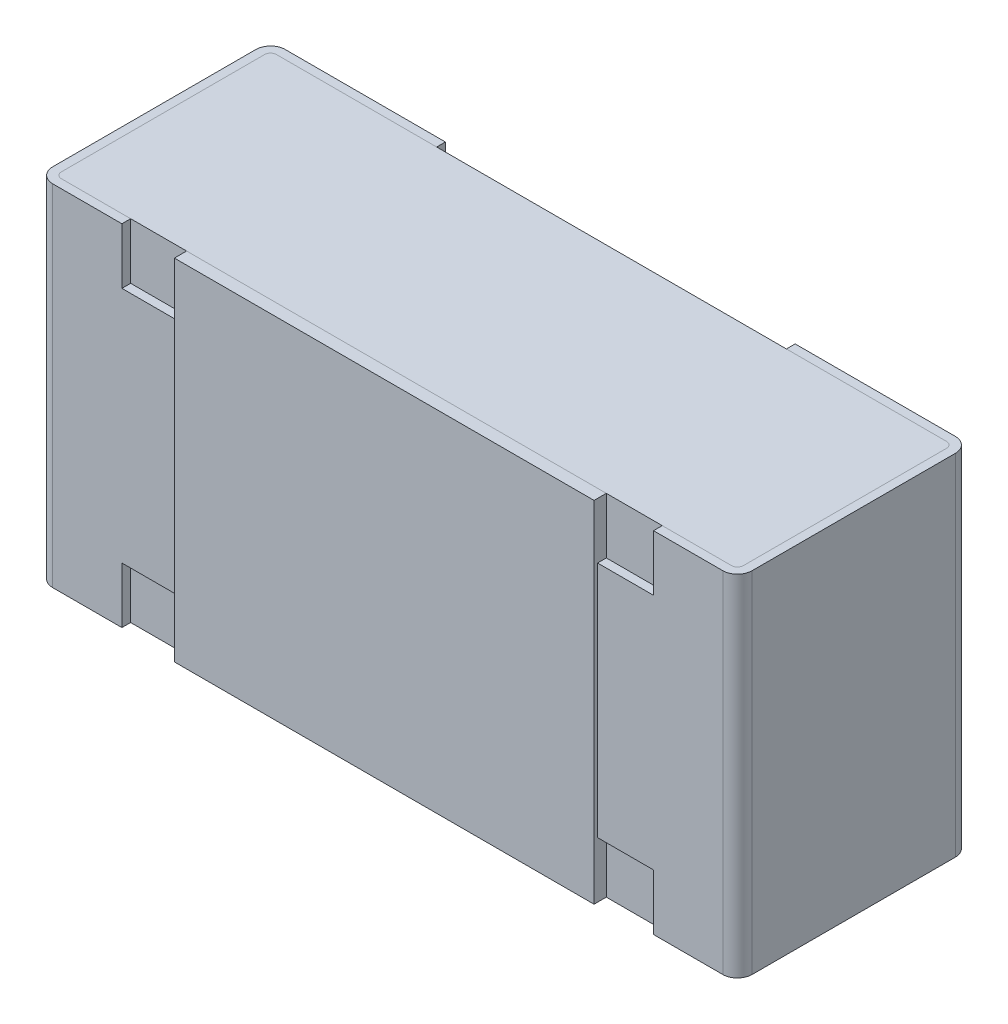
ISO-10303-21;
HEADER;
FILE_DESCRIPTION(('STEP AP214'),'2;1');
FILE_NAME('part.step','',(''),(''),'','','');
FILE_SCHEMA(('AUTOMOTIVE_DESIGN { 1 0 10303 214 1 1 1 1 }'));
ENDSEC;
DATA;
#1=APPLICATION_CONTEXT('core data for automotive mechanical design processes');
#2=APPLICATION_PROTOCOL_DEFINITION('international standard','automotive_design',2000,#1);
#3=PRODUCT_CONTEXT('',#1,'mechanical');
#4=PRODUCT('Part','Part','',(#3));
#5=PRODUCT_RELATED_PRODUCT_CATEGORY('part','',(#4));
#6=PRODUCT_DEFINITION_FORMATION('','',#4);
#7=PRODUCT_DEFINITION_CONTEXT('part definition',#1,'design');
#8=PRODUCT_DEFINITION('design','',#6,#7);
#9=PRODUCT_DEFINITION_SHAPE('','',#8);
#10=(LENGTH_UNIT() NAMED_UNIT(*) SI_UNIT(.MILLI.,.METRE.));
#11=(NAMED_UNIT(*) PLANE_ANGLE_UNIT() SI_UNIT($,.RADIAN.));
#12=(NAMED_UNIT(*) SI_UNIT($,.STERADIAN.) SOLID_ANGLE_UNIT());
#13=UNCERTAINTY_MEASURE_WITH_UNIT(LENGTH_MEASURE(1.E-05),#10,'distance_accuracy_value','');
#14=(GEOMETRIC_REPRESENTATION_CONTEXT(3) GLOBAL_UNCERTAINTY_ASSIGNED_CONTEXT((#13)) GLOBAL_UNIT_ASSIGNED_CONTEXT((#10,
#11,#12)) REPRESENTATION_CONTEXT('',''));
#15=CARTESIAN_POINT('',(0.,0.,0.));
#16=DIRECTION('',(0.,0.,1.));
#17=DIRECTION('',(1.,0.,0.));
#18=AXIS2_PLACEMENT_3D('',#15,#16,#17);
#19=CARTESIAN_POINT('',(0.3,-0.17,0.20686291501));
#20=DIRECTION('',(0.,1.,0.));
#21=DIRECTION('',(1.,0.,0.));
#22=AXIS2_PLACEMENT_3D('',#19,#20,#21);
#23=PLANE('',#22);
#24=DIRECTION('',(0.,0.,1.));
#25=VECTOR('',#24,1.);
#26=CARTESIAN_POINT('',(0.38,-0.17,0.32));
#27=LINE('',#26,#25);
#28=CARTESIAN_POINT('',(0.38,-0.17,0.32));
#29=VERTEX_POINT('',#28);
#30=CARTESIAN_POINT('',(0.38,-0.17,0.3325));
#31=VERTEX_POINT('',#30);
#32=EDGE_CURVE('E11',#29,#31,#27,.T.);
#33=ORIENTED_EDGE('',*,*,#32,.T.);
#34=DIRECTION('',(-1.,0.,0.));
#35=VECTOR('',#34,1.);
#36=CARTESIAN_POINT('',(0.38,-0.17,0.3325));
#37=LINE('',#36,#35);
#38=CARTESIAN_POINT('',(0.3,-0.17,0.3325));
#39=VERTEX_POINT('',#38);
#40=EDGE_CURVE('E365',#31,#39,#37,.T.);
#41=ORIENTED_EDGE('',*,*,#40,.T.);
#42=DIRECTION('',(0.,0.,1.));
#43=VECTOR('',#42,1.);
#44=CARTESIAN_POINT('',(0.3,-0.17,0.32));
#45=LINE('',#44,#43);
#46=CARTESIAN_POINT('',(0.3,-0.17,0.32));
#47=VERTEX_POINT('',#46);
#48=EDGE_CURVE('E435',#47,#39,#45,.T.);
#49=ORIENTED_EDGE('',*,*,#48,.F.);
#50=DIRECTION('',(-1.,0.,0.));
#51=VECTOR('',#50,1.);
#52=CARTESIAN_POINT('',(0.38,-0.17,0.32));
#53=LINE('',#52,#51);
#54=EDGE_CURVE('E484',#29,#47,#53,.T.);
#55=ORIENTED_EDGE('',*,*,#54,.F.);
#56=EDGE_LOOP('',(#33,#41,#49,#55));
#57=FACE_BOUND('',#56,.T.);
#58=ADVANCED_FACE('F17',(#57),#23,.F.);
#59=CARTESIAN_POINT('',(0.38,-0.25,0.20686291501));
#60=DIRECTION('',(1.,0.,0.));
#61=DIRECTION('',(0.,-1.,0.));
#62=AXIS2_PLACEMENT_3D('',#59,#60,#61);
#63=PLANE('',#62);
#64=DIRECTION('',(0.,0.,1.));
#65=VECTOR('',#64,1.);
#66=CARTESIAN_POINT('',(0.38,-0.25,0.32));
#67=LINE('',#66,#65);
#68=CARTESIAN_POINT('',(0.38,-0.25,0.32));
#69=VERTEX_POINT('',#68);
#70=CARTESIAN_POINT('',(0.38,-0.25,0.3325));
#71=VERTEX_POINT('',#70);
#72=EDGE_CURVE('E441',#69,#71,#67,.T.);
#73=ORIENTED_EDGE('',*,*,#72,.T.);
#74=DIRECTION('',(0.,1.,0.));
#75=VECTOR('',#74,1.);
#76=CARTESIAN_POINT('',(0.38,-0.25,0.3325));
#77=LINE('',#76,#75);
#78=EDGE_CURVE('E333',#71,#31,#77,.T.);
#79=ORIENTED_EDGE('',*,*,#78,.T.);
#80=ORIENTED_EDGE('',*,*,#32,.F.);
#81=DIRECTION('',(0.,1.,0.));
#82=VECTOR('',#81,1.);
#83=CARTESIAN_POINT('',(0.38,-0.25,0.32));
#84=LINE('',#83,#82);
#85=EDGE_CURVE('E480',#69,#29,#84,.T.);
#86=ORIENTED_EDGE('',*,*,#85,.F.);
#87=EDGE_LOOP('',(#73,#79,#80,#86));
#88=FACE_BOUND('',#87,.T.);
#89=ADVANCED_FACE('F1038',(#88),#63,.F.);
#90=CARTESIAN_POINT('',(0.38,0.25,0.20686291501));
#91=DIRECTION('',(1.,0.,0.));
#92=DIRECTION('',(0.,1.,0.));
#93=AXIS2_PLACEMENT_3D('',#90,#91,#92);
#94=PLANE('',#93);
#95=DIRECTION('',(0.,0.,1.));
#96=VECTOR('',#95,1.);
#97=CARTESIAN_POINT('',(0.38,0.17,0.32));
#98=LINE('',#97,#96);
#99=CARTESIAN_POINT('',(0.38,0.17,0.32));
#100=VERTEX_POINT('',#99);
#101=CARTESIAN_POINT('',(0.38,0.17,0.3325));
#102=VERTEX_POINT('',#101);
#103=EDGE_CURVE('E25',#100,#102,#98,.T.);
#104=ORIENTED_EDGE('',*,*,#103,.T.);
#105=DIRECTION('',(0.,1.,0.));
#106=VECTOR('',#105,1.);
#107=CARTESIAN_POINT('',(0.38,0.17,0.3325));
#108=LINE('',#107,#106);
#109=CARTESIAN_POINT('',(0.38,0.25,0.3325));
#110=VERTEX_POINT('',#109);
#111=EDGE_CURVE('E324',#102,#110,#108,.T.);
#112=ORIENTED_EDGE('',*,*,#111,.T.);
#113=DIRECTION('',(0.,0.,1.));
#114=VECTOR('',#113,1.);
#115=CARTESIAN_POINT('',(0.38,0.25,0.32));
#116=LINE('',#115,#114);
#117=CARTESIAN_POINT('',(0.38,0.25,0.32));
#118=VERTEX_POINT('',#117);
#119=EDGE_CURVE('E328',#118,#110,#116,.T.);
#120=ORIENTED_EDGE('',*,*,#119,.F.);
#121=DIRECTION('',(0.,1.,0.));
#122=VECTOR('',#121,1.);
#123=CARTESIAN_POINT('',(0.38,0.17,0.32));
#124=LINE('',#123,#122);
#125=EDGE_CURVE('E456',#100,#118,#124,.T.);
#126=ORIENTED_EDGE('',*,*,#125,.F.);
#127=EDGE_LOOP('',(#104,#112,#120,#126));
#128=FACE_BOUND('',#127,.T.);
#129=ADVANCED_FACE('F326',(#128),#94,.F.);
#130=CARTESIAN_POINT('',(0.3,0.17,0.20686291501));
#131=DIRECTION('',(0.,-1.,0.));
#132=DIRECTION('',(0.,0.,-1.));
#133=AXIS2_PLACEMENT_3D('',#130,#131,#132);
#134=PLANE('',#133);
#135=DIRECTION('',(0.,0.,1.));
#136=VECTOR('',#135,1.);
#137=CARTESIAN_POINT('',(0.3,0.17,0.32));
#138=LINE('',#137,#136);
#139=CARTESIAN_POINT('',(0.3,0.17,0.32));
#140=VERTEX_POINT('',#139);
#141=CARTESIAN_POINT('',(0.3,0.17,0.3325));
#142=VERTEX_POINT('',#141);
#143=EDGE_CURVE('E587',#140,#142,#138,.T.);
#144=ORIENTED_EDGE('',*,*,#143,.T.);
#145=DIRECTION('',(1.,0.,0.));
#146=VECTOR('',#145,1.);
#147=CARTESIAN_POINT('',(0.3,0.17,0.3325));
#148=LINE('',#147,#146);
#149=EDGE_CURVE('E332',#142,#102,#148,.T.);
#150=ORIENTED_EDGE('',*,*,#149,.T.);
#151=ORIENTED_EDGE('',*,*,#103,.F.);
#152=DIRECTION('',(1.,0.,0.));
#153=VECTOR('',#152,1.);
#154=CARTESIAN_POINT('',(0.3,0.17,0.32));
#155=LINE('',#154,#153);
#156=EDGE_CURVE('E461',#140,#100,#155,.T.);
#157=ORIENTED_EDGE('',*,*,#156,.F.);
#158=EDGE_LOOP('',(#144,#150,#151,#157));
#159=FACE_BOUND('',#158,.T.);
#160=ADVANCED_FACE('F1052',(#159),#134,.F.);
#161=CARTESIAN_POINT('',(0.5,0.,0.3325));
#162=DIRECTION('',(0.,0.,-1.));
#163=DIRECTION('',(-1.,0.,0.));
#164=AXIS2_PLACEMENT_3D('',#161,#162,#163);
#165=PLANE('',#164);
#166=ORIENTED_EDGE('',*,*,#40,.F.);
#167=ORIENTED_EDGE('',*,*,#78,.F.);
#168=DIRECTION('',(-1.,0.,0.));
#169=VECTOR('',#168,1.);
#170=CARTESIAN_POINT('',(0.479,-0.25,0.3325));
#171=LINE('',#170,#169);
#172=CARTESIAN_POINT('',(0.479,-0.25,0.3325));
#173=VERTEX_POINT('',#172);
#174=EDGE_CURVE('E446',#173,#71,#171,.T.);
#175=ORIENTED_EDGE('',*,*,#174,.F.);
#176=DIRECTION('',(0.,1.,0.));
#177=VECTOR('',#176,1.);
#178=CARTESIAN_POINT('',(0.479,-0.25,0.3325));
#179=LINE('',#178,#177);
#180=CARTESIAN_POINT('',(0.479,0.25,0.3325));
#181=VERTEX_POINT('',#180);
#182=EDGE_CURVE('E340',#173,#181,#179,.T.);
#183=ORIENTED_EDGE('',*,*,#182,.T.);
#184=DIRECTION('',(-1.,0.,0.));
#185=VECTOR('',#184,1.);
#186=CARTESIAN_POINT('',(0.479,0.25,0.3325));
#187=LINE('',#186,#185);
#188=EDGE_CURVE('E336',#181,#110,#187,.T.);
#189=ORIENTED_EDGE('',*,*,#188,.T.);
#190=ORIENTED_EDGE('',*,*,#111,.F.);
#191=ORIENTED_EDGE('',*,*,#149,.F.);
#192=DIRECTION('',(0.,1.,0.));
#193=VECTOR('',#192,1.);
#194=CARTESIAN_POINT('',(0.3,-0.17,0.3325));
#195=LINE('',#194,#193);
#196=EDGE_CURVE('E439',#39,#142,#195,.T.);
#197=ORIENTED_EDGE('',*,*,#196,.F.);
#198=EDGE_LOOP('',(#166,#167,#175,#183,#189,#190,#191,#197));
#199=FACE_BOUND('',#198,.T.);
#200=ADVANCED_FACE('F338',(#199),#165,.F.);
#201=CARTESIAN_POINT('',(0.479,0.,0.3115));
#202=DIRECTION('',(0.,-1.,0.));
#203=DIRECTION('',(0.,0.,-1.));
#204=AXIS2_PLACEMENT_3D('',#201,#202,#203);
#205=CYLINDRICAL_SURFACE('',#204,0.021);
#206=CARTESIAN_POINT('',(0.479,-0.25,0.3115));
#207=DIRECTION('',(0.,1.,0.));
#208=DIRECTION('',(0.,0.,1.));
#209=AXIS2_PLACEMENT_3D('',#206,#207,#208);
#210=CIRCLE('',#209,0.021);
#211=CARTESIAN_POINT('',(0.5,-0.25,0.3115));
#212=VERTEX_POINT('',#211);
#213=EDGE_CURVE('E500',#173,#212,#210,.T.);
#214=ORIENTED_EDGE('',*,*,#213,.T.);
#215=DIRECTION('',(0.,1.,0.));
#216=VECTOR('',#215,1.);
#217=CARTESIAN_POINT('',(0.5,-0.25,0.3115));
#218=LINE('',#217,#216);
#219=CARTESIAN_POINT('',(0.5,0.25,0.3115));
#220=VERTEX_POINT('',#219);
#221=EDGE_CURVE('E475',#212,#220,#218,.T.);
#222=ORIENTED_EDGE('',*,*,#221,.T.);
#223=CARTESIAN_POINT('',(0.479,0.25,0.3115));
#224=DIRECTION('',(0.,-1.,0.));
#225=DIRECTION('',(0.,0.,-1.));
#226=AXIS2_PLACEMENT_3D('',#223,#224,#225);
#227=CIRCLE('',#226,0.021);
#228=EDGE_CURVE('E345',#220,#181,#227,.T.);
#229=ORIENTED_EDGE('',*,*,#228,.T.);
#230=ORIENTED_EDGE('',*,*,#182,.F.);
#231=EDGE_LOOP('',(#214,#222,#229,#230));
#232=FACE_BOUND('',#231,.T.);
#233=ADVANCED_FACE('F673',(#232),#205,.T.);
#234=CARTESIAN_POINT('',(0.25,0.,0.));
#235=DIRECTION('',(1.,0.,0.));
#236=DIRECTION('',(0.,0.,1.));
#237=AXIS2_PLACEMENT_3D('',#234,#235,#236);
#238=PLANE('',#237);
#239=DIRECTION('',(0.,0.,1.));
#240=VECTOR('',#239,1.);
#241=CARTESIAN_POINT('',(0.25,0.25,0.));
#242=LINE('',#241,#240);
#243=CARTESIAN_POINT('',(0.25,0.25,0.));
#244=VERTEX_POINT('',#243);
#245=CARTESIAN_POINT('',(0.25,0.25,0.0125));
#246=VERTEX_POINT('',#245);
#247=EDGE_CURVE('E730',#244,#246,#242,.T.);
#248=ORIENTED_EDGE('',*,*,#247,.F.);
#249=DIRECTION('',(0.,1.,0.));
#250=VECTOR('',#249,1.);
#251=CARTESIAN_POINT('',(0.25,-0.25,0.));
#252=LINE('',#251,#250);
#253=CARTESIAN_POINT('',(0.25,-0.25,0.));
#254=VERTEX_POINT('',#253);
#255=EDGE_CURVE('E544',#254,#244,#252,.T.);
#256=ORIENTED_EDGE('',*,*,#255,.F.);
#257=DIRECTION('',(0.,0.,1.));
#258=VECTOR('',#257,1.);
#259=CARTESIAN_POINT('',(0.25,-0.25,0.));
#260=LINE('',#259,#258);
#261=CARTESIAN_POINT('',(0.25,-0.25,0.0125));
#262=VERTEX_POINT('',#261);
#263=EDGE_CURVE('E575',#254,#262,#260,.T.);
#264=ORIENTED_EDGE('',*,*,#263,.T.);
#265=DIRECTION('',(0.,1.,0.));
#266=VECTOR('',#265,1.);
#267=CARTESIAN_POINT('',(0.25,-0.25,0.0125));
#268=LINE('',#267,#266);
#269=EDGE_CURVE('E416',#262,#246,#268,.T.);
#270=ORIENTED_EDGE('',*,*,#269,.T.);
#271=EDGE_LOOP('',(#248,#256,#264,#270));
#272=FACE_BOUND('',#271,.T.);
#273=ADVANCED_FACE('F732',(#272),#238,.F.);
#274=CARTESIAN_POINT('',(0.25,0.,0.));
#275=DIRECTION('',(0.,0.,1.));
#276=DIRECTION('',(1.,0.,0.));
#277=AXIS2_PLACEMENT_3D('',#274,#275,#276);
#278=PLANE('',#277);
#279=DIRECTION('',(1.,0.,0.));
#280=VECTOR('',#279,1.);
#281=CARTESIAN_POINT('',(0.25,-0.25,0.));
#282=LINE('',#281,#280);
#283=CARTESIAN_POINT('',(0.479,-0.25,0.));
#284=VERTEX_POINT('',#283);
#285=EDGE_CURVE('E583',#254,#284,#282,.T.);
#286=ORIENTED_EDGE('',*,*,#285,.F.);
#287=ORIENTED_EDGE('',*,*,#255,.T.);
#288=DIRECTION('',(1.,0.,0.));
#289=VECTOR('',#288,1.);
#290=CARTESIAN_POINT('',(0.25,0.25,0.));
#291=LINE('',#290,#289);
#292=CARTESIAN_POINT('',(0.479,0.25,0.));
#293=VERTEX_POINT('',#292);
#294=EDGE_CURVE('E370',#244,#293,#291,.T.);
#295=ORIENTED_EDGE('',*,*,#294,.T.);
#296=DIRECTION('',(0.,1.,0.));
#297=VECTOR('',#296,1.);
#298=CARTESIAN_POINT('',(0.479,-0.25,0.));
#299=LINE('',#298,#297);
#300=EDGE_CURVE('E474',#284,#293,#299,.T.);
#301=ORIENTED_EDGE('',*,*,#300,.F.);
#302=EDGE_LOOP('',(#286,#287,#295,#301));
#303=FACE_BOUND('',#302,.T.);
#304=ADVANCED_FACE('F727',(#303),#278,.F.);
#305=CARTESIAN_POINT('',(0.479,0.,0.021));
#306=DIRECTION('',(0.,-1.,0.));
#307=DIRECTION('',(0.,0.,-1.));
#308=AXIS2_PLACEMENT_3D('',#305,#306,#307);
#309=CYLINDRICAL_SURFACE('',#308,0.021);
#310=CARTESIAN_POINT('',(0.479,-0.25,0.021));
#311=DIRECTION('',(0.,1.,0.));
#312=DIRECTION('',(0.,0.,1.));
#313=AXIS2_PLACEMENT_3D('',#310,#311,#312);
#314=CIRCLE('',#313,0.021);
#315=CARTESIAN_POINT('',(0.5,-0.25,0.021));
#316=VERTEX_POINT('',#315);
#317=EDGE_CURVE('E501',#316,#284,#314,.T.);
#318=ORIENTED_EDGE('',*,*,#317,.T.);
#319=ORIENTED_EDGE('',*,*,#300,.T.);
#320=CARTESIAN_POINT('',(0.479,0.25,0.021));
#321=DIRECTION('',(0.,-1.,0.));
#322=DIRECTION('',(0.,0.,-1.));
#323=AXIS2_PLACEMENT_3D('',#320,#321,#322);
#324=CIRCLE('',#323,0.021);
#325=CARTESIAN_POINT('',(0.5,0.25,0.021));
#326=VERTEX_POINT('',#325);
#327=EDGE_CURVE('E366',#293,#326,#324,.T.);
#328=ORIENTED_EDGE('',*,*,#327,.T.);
#329=DIRECTION('',(0.,1.,0.));
#330=VECTOR('',#329,1.);
#331=CARTESIAN_POINT('',(0.5,-0.25,0.021));
#332=LINE('',#331,#330);
#333=EDGE_CURVE('E471',#316,#326,#332,.T.);
#334=ORIENTED_EDGE('',*,*,#333,.F.);
#335=EDGE_LOOP('',(#318,#319,#328,#334));
#336=FACE_BOUND('',#335,.T.);
#337=ADVANCED_FACE('F722',(#336),#309,.T.);
#338=CARTESIAN_POINT('',(0.5,0.,0.));
#339=DIRECTION('',(-1.,0.,0.));
#340=DIRECTION('',(0.,0.,1.));
#341=AXIS2_PLACEMENT_3D('',#338,#339,#340);
#342=PLANE('',#341);
#343=DIRECTION('',(0.,0.,1.));
#344=VECTOR('',#343,1.);
#345=CARTESIAN_POINT('',(0.5,0.25,0.021));
#346=LINE('',#345,#344);
#347=EDGE_CURVE('E371',#326,#220,#346,.T.);
#348=ORIENTED_EDGE('',*,*,#347,.T.);
#349=ORIENTED_EDGE('',*,*,#221,.F.);
#350=DIRECTION('',(0.,0.,1.));
#351=VECTOR('',#350,1.);
#352=CARTESIAN_POINT('',(0.5,-0.25,0.021));
#353=LINE('',#352,#351);
#354=EDGE_CURVE('E496',#316,#212,#353,.T.);
#355=ORIENTED_EDGE('',*,*,#354,.F.);
#356=ORIENTED_EDGE('',*,*,#333,.T.);
#357=EDGE_LOOP('',(#348,#349,#355,#356));
#358=FACE_BOUND('',#357,.T.);
#359=ADVANCED_FACE('F678',(#358),#342,.F.);
#360=CARTESIAN_POINT('',(-0.3,0.17,0.20686291501));
#361=DIRECTION('',(0.,-1.,0.));
#362=DIRECTION('',(0.,0.,-1.));
#363=AXIS2_PLACEMENT_3D('',#360,#361,#362);
#364=PLANE('',#363);
#365=DIRECTION('',(0.,0.,1.));
#366=VECTOR('',#365,1.);
#367=CARTESIAN_POINT('',(-0.38,0.17,0.32));
#368=LINE('',#367,#366);
#369=CARTESIAN_POINT('',(-0.38,0.17,0.32));
#370=VERTEX_POINT('',#369);
#371=CARTESIAN_POINT('',(-0.38,0.17,0.3325));
#372=VERTEX_POINT('',#371);
#373=EDGE_CURVE('E666',#370,#372,#368,.T.);
#374=ORIENTED_EDGE('',*,*,#373,.T.);
#375=DIRECTION('',(1.,0.,0.));
#376=VECTOR('',#375,1.);
#377=CARTESIAN_POINT('',(-0.38,0.17,0.3325));
#378=LINE('',#377,#376);
#379=CARTESIAN_POINT('',(-0.3,0.17,0.3325));
#380=VERTEX_POINT('',#379);
#381=EDGE_CURVE('E565',#372,#380,#378,.T.);
#382=ORIENTED_EDGE('',*,*,#381,.T.);
#383=DIRECTION('',(0.,0.,1.));
#384=VECTOR('',#383,1.);
#385=CARTESIAN_POINT('',(-0.3,0.17,0.32));
#386=LINE('',#385,#384);
#387=CARTESIAN_POINT('',(-0.3,0.17,0.32));
#388=VERTEX_POINT('',#387);
#389=EDGE_CURVE('E455',#388,#380,#386,.T.);
#390=ORIENTED_EDGE('',*,*,#389,.F.);
#391=DIRECTION('',(1.,0.,0.));
#392=VECTOR('',#391,1.);
#393=CARTESIAN_POINT('',(-0.38,0.17,0.32));
#394=LINE('',#393,#392);
#395=EDGE_CURVE('E505',#370,#388,#394,.T.);
#396=ORIENTED_EDGE('',*,*,#395,.F.);
#397=EDGE_LOOP('',(#374,#382,#390,#396));
#398=FACE_BOUND('',#397,.T.);
#399=ADVANCED_FACE('F1096',(#398),#364,.F.);
#400=CARTESIAN_POINT('',(-0.38,0.25,0.20686291501));
#401=DIRECTION('',(-1.,0.,0.));
#402=DIRECTION('',(0.,0.,1.));
#403=AXIS2_PLACEMENT_3D('',#400,#401,#402);
#404=PLANE('',#403);
#405=DIRECTION('',(0.,0.,1.));
#406=VECTOR('',#405,1.);
#407=CARTESIAN_POINT('',(-0.38,0.25,0.32));
#408=LINE('',#407,#406);
#409=CARTESIAN_POINT('',(-0.38,0.25,0.32));
#410=VERTEX_POINT('',#409);
#411=CARTESIAN_POINT('',(-0.38,0.25,0.3325));
#412=VERTEX_POINT('',#411);
#413=EDGE_CURVE('E466',#410,#412,#408,.T.);
#414=ORIENTED_EDGE('',*,*,#413,.T.);
#415=DIRECTION('',(0.,-1.,0.));
#416=VECTOR('',#415,1.);
#417=CARTESIAN_POINT('',(-0.38,0.25,0.3325));
#418=LINE('',#417,#416);
#419=EDGE_CURVE('E629',#412,#372,#418,.T.);
#420=ORIENTED_EDGE('',*,*,#419,.T.);
#421=ORIENTED_EDGE('',*,*,#373,.F.);
#422=DIRECTION('',(0.,-1.,0.));
#423=VECTOR('',#422,1.);
#424=CARTESIAN_POINT('',(-0.38,0.25,0.32));
#425=LINE('',#424,#423);
#426=EDGE_CURVE('E510',#410,#370,#425,.T.);
#427=ORIENTED_EDGE('',*,*,#426,.F.);
#428=EDGE_LOOP('',(#414,#420,#421,#427));
#429=FACE_BOUND('',#428,.T.);
#430=ADVANCED_FACE('F1111',(#429),#404,.F.);
#431=CARTESIAN_POINT('',(-0.38,-0.25,0.20686291501));
#432=DIRECTION('',(-1.,0.,0.));
#433=DIRECTION('',(0.,0.,1.));
#434=AXIS2_PLACEMENT_3D('',#431,#432,#433);
#435=PLANE('',#434);
#436=DIRECTION('',(0.,0.,1.));
#437=VECTOR('',#436,1.);
#438=CARTESIAN_POINT('',(-0.38,-0.17,0.32));
#439=LINE('',#438,#437);
#440=CARTESIAN_POINT('',(-0.38,-0.17,0.32));
#441=VERTEX_POINT('',#440);
#442=CARTESIAN_POINT('',(-0.38,-0.17,0.3325));
#443=VERTEX_POINT('',#442);
#444=EDGE_CURVE('E375',#441,#443,#439,.T.);
#445=ORIENTED_EDGE('',*,*,#444,.T.);
#446=DIRECTION('',(0.,-1.,0.));
#447=VECTOR('',#446,1.);
#448=CARTESIAN_POINT('',(-0.38,-0.17,0.3325));
#449=LINE('',#448,#447);
#450=CARTESIAN_POINT('',(-0.38,-0.25,0.3325));
#451=VERTEX_POINT('',#450);
#452=EDGE_CURVE('E430',#443,#451,#449,.T.);
#453=ORIENTED_EDGE('',*,*,#452,.T.);
#454=DIRECTION('',(0.,0.,1.));
#455=VECTOR('',#454,1.);
#456=CARTESIAN_POINT('',(-0.38,-0.25,0.32));
#457=LINE('',#456,#455);
#458=CARTESIAN_POINT('',(-0.38,-0.25,0.32));
#459=VERTEX_POINT('',#458);
#460=EDGE_CURVE('E525',#459,#451,#457,.T.);
#461=ORIENTED_EDGE('',*,*,#460,.F.);
#462=DIRECTION('',(0.,-1.,0.));
#463=VECTOR('',#462,1.);
#464=CARTESIAN_POINT('',(-0.38,-0.17,0.32));
#465=LINE('',#464,#463);
#466=EDGE_CURVE('E538',#441,#459,#465,.T.);
#467=ORIENTED_EDGE('',*,*,#466,.F.);
#468=EDGE_LOOP('',(#445,#453,#461,#467));
#469=FACE_BOUND('',#468,.T.);
#470=ADVANCED_FACE('F1117',(#469),#435,.F.);
#471=CARTESIAN_POINT('',(-0.3,-0.17,0.20686291501));
#472=DIRECTION('',(0.,1.,0.));
#473=DIRECTION('',(1.,0.,0.));
#474=AXIS2_PLACEMENT_3D('',#471,#472,#473);
#475=PLANE('',#474);
#476=DIRECTION('',(0.,0.,1.));
#477=VECTOR('',#476,1.);
#478=CARTESIAN_POINT('',(-0.3,-0.17,0.32));
#479=LINE('',#478,#477);
#480=CARTESIAN_POINT('',(-0.3,-0.17,0.32));
#481=VERTEX_POINT('',#480);
#482=CARTESIAN_POINT('',(-0.3,-0.17,0.3325));
#483=VERTEX_POINT('',#482);
#484=EDGE_CURVE('E641',#481,#483,#479,.T.);
#485=ORIENTED_EDGE('',*,*,#484,.T.);
#486=DIRECTION('',(-1.,0.,0.));
#487=VECTOR('',#486,1.);
#488=CARTESIAN_POINT('',(-0.3,-0.17,0.3325));
#489=LINE('',#488,#487);
#490=EDGE_CURVE('E425',#483,#443,#489,.T.);
#491=ORIENTED_EDGE('',*,*,#490,.T.);
#492=ORIENTED_EDGE('',*,*,#444,.F.);
#493=DIRECTION('',(-1.,0.,0.));
#494=VECTOR('',#493,1.);
#495=CARTESIAN_POINT('',(-0.3,-0.17,0.32));
#496=LINE('',#495,#494);
#497=EDGE_CURVE('E534',#481,#441,#496,.T.);
#498=ORIENTED_EDGE('',*,*,#497,.F.);
#499=EDGE_LOOP('',(#485,#491,#492,#498));
#500=FACE_BOUND('',#499,.T.);
#501=ADVANCED_FACE('F1121',(#500),#475,.F.);
#502=CARTESIAN_POINT('',(-0.479,0.,0.3115));
#503=DIRECTION('',(0.,-1.,0.));
#504=DIRECTION('',(0.,0.,-1.));
#505=AXIS2_PLACEMENT_3D('',#502,#503,#504);
#506=CYLINDRICAL_SURFACE('',#505,0.021);
#507=CARTESIAN_POINT('',(-0.479,-0.25,0.3115));
#508=DIRECTION('',(0.,1.,0.));
#509=DIRECTION('',(0.,0.,1.));
#510=AXIS2_PLACEMENT_3D('',#507,#508,#509);
#511=CIRCLE('',#510,0.021);
#512=CARTESIAN_POINT('',(-0.5,-0.25,0.3115));
#513=VERTEX_POINT('',#512);
#514=CARTESIAN_POINT('',(-0.479,-0.25,0.3325));
#515=VERTEX_POINT('',#514);
#516=EDGE_CURVE('E533',#513,#515,#511,.T.);
#517=ORIENTED_EDGE('',*,*,#516,.T.);
#518=DIRECTION('',(0.,1.,0.));
#519=VECTOR('',#518,1.);
#520=CARTESIAN_POINT('',(-0.479,-0.25,0.3325));
#521=LINE('',#520,#519);
#522=CARTESIAN_POINT('',(-0.479,0.25,0.3325));
#523=VERTEX_POINT('',#522);
#524=EDGE_CURVE('E594',#515,#523,#521,.T.);
#525=ORIENTED_EDGE('',*,*,#524,.T.);
#526=CARTESIAN_POINT('',(-0.479,0.25,0.3115));
#527=DIRECTION('',(0.,-1.,0.));
#528=DIRECTION('',(0.,0.,-1.));
#529=AXIS2_PLACEMENT_3D('',#526,#527,#528);
#530=CIRCLE('',#529,0.021);
#531=CARTESIAN_POINT('',(-0.5,0.25,0.3115));
#532=VERTEX_POINT('',#531);
#533=EDGE_CURVE('E361',#523,#532,#530,.T.);
#534=ORIENTED_EDGE('',*,*,#533,.T.);
#535=DIRECTION('',(0.,1.,0.));
#536=VECTOR('',#535,1.);
#537=CARTESIAN_POINT('',(-0.5,-0.25,0.3115));
#538=LINE('',#537,#536);
#539=EDGE_CURVE('E392',#513,#532,#538,.T.);
#540=ORIENTED_EDGE('',*,*,#539,.F.);
#541=EDGE_LOOP('',(#517,#525,#534,#540));
#542=FACE_BOUND('',#541,.T.);
#543=ADVANCED_FACE('F1130',(#542),#506,.T.);
#544=CARTESIAN_POINT('',(-0.479,0.,0.021));
#545=DIRECTION('',(0.,-1.,0.));
#546=DIRECTION('',(0.,0.,-1.));
#547=AXIS2_PLACEMENT_3D('',#544,#545,#546);
#548=CYLINDRICAL_SURFACE('',#547,0.021);
#549=CARTESIAN_POINT('',(-0.479,-0.25,0.021));
#550=DIRECTION('',(0.,1.,0.));
#551=DIRECTION('',(0.,0.,1.));
#552=AXIS2_PLACEMENT_3D('',#549,#550,#551);
#553=CIRCLE('',#552,0.021);
#554=CARTESIAN_POINT('',(-0.479,-0.25,0.));
#555=VERTEX_POINT('',#554);
#556=CARTESIAN_POINT('',(-0.5,-0.25,0.021));
#557=VERTEX_POINT('',#556);
#558=EDGE_CURVE('E543',#555,#557,#553,.T.);
#559=ORIENTED_EDGE('',*,*,#558,.T.);
#560=DIRECTION('',(0.,1.,0.));
#561=VECTOR('',#560,1.);
#562=CARTESIAN_POINT('',(-0.5,-0.25,0.021));
#563=LINE('',#562,#561);
#564=CARTESIAN_POINT('',(-0.5,0.25,0.021));
#565=VERTEX_POINT('',#564);
#566=EDGE_CURVE('E376',#557,#565,#563,.T.);
#567=ORIENTED_EDGE('',*,*,#566,.T.);
#568=CARTESIAN_POINT('',(-0.479,0.25,0.021));
#569=DIRECTION('',(0.,-1.,0.));
#570=DIRECTION('',(0.,0.,-1.));
#571=AXIS2_PLACEMENT_3D('',#568,#569,#570);
#572=CIRCLE('',#571,0.021);
#573=CARTESIAN_POINT('',(-0.479,0.25,0.));
#574=VERTEX_POINT('',#573);
#575=EDGE_CURVE('E424',#565,#574,#572,.T.);
#576=ORIENTED_EDGE('',*,*,#575,.T.);
#577=DIRECTION('',(0.,1.,0.));
#578=VECTOR('',#577,1.);
#579=CARTESIAN_POINT('',(-0.479,-0.25,0.));
#580=LINE('',#579,#578);
#581=EDGE_CURVE('E372',#555,#574,#580,.T.);
#582=ORIENTED_EDGE('',*,*,#581,.F.);
#583=EDGE_LOOP('',(#559,#567,#576,#582));
#584=FACE_BOUND('',#583,.T.);
#585=ADVANCED_FACE('F767',(#584),#548,.T.);
#586=CARTESIAN_POINT('',(-0.5,0.,0.));
#587=DIRECTION('',(0.,0.,1.));
#588=DIRECTION('',(1.,0.,0.));
#589=AXIS2_PLACEMENT_3D('',#586,#587,#588);
#590=PLANE('',#589);
#591=DIRECTION('',(1.,0.,0.));
#592=VECTOR('',#591,1.);
#593=CARTESIAN_POINT('',(-0.479,0.25,0.));
#594=LINE('',#593,#592);
#595=CARTESIAN_POINT('',(-0.25,0.25,0.));
#596=VERTEX_POINT('',#595);
#597=EDGE_CURVE('E420',#574,#596,#594,.T.);
#598=ORIENTED_EDGE('',*,*,#597,.T.);
#599=DIRECTION('',(0.,1.,0.));
#600=VECTOR('',#599,1.);
#601=CARTESIAN_POINT('',(-0.25,-0.25,0.));
#602=LINE('',#601,#600);
#603=CARTESIAN_POINT('',(-0.25,-0.25,0.));
#604=VERTEX_POINT('',#603);
#605=EDGE_CURVE('E429',#604,#596,#602,.T.);
#606=ORIENTED_EDGE('',*,*,#605,.F.);
#607=DIRECTION('',(1.,0.,0.));
#608=VECTOR('',#607,1.);
#609=CARTESIAN_POINT('',(-0.479,-0.25,0.));
#610=LINE('',#609,#608);
#611=EDGE_CURVE('E550',#555,#604,#610,.T.);
#612=ORIENTED_EDGE('',*,*,#611,.F.);
#613=ORIENTED_EDGE('',*,*,#581,.T.);
#614=EDGE_LOOP('',(#598,#606,#612,#613));
#615=FACE_BOUND('',#614,.T.);
#616=ADVANCED_FACE('F763',(#615),#590,.F.);
#617=CARTESIAN_POINT('',(-0.5,0.,0.3325));
#618=DIRECTION('',(1.,0.,0.));
#619=DIRECTION('',(0.,1.,0.));
#620=AXIS2_PLACEMENT_3D('',#617,#618,#619);
#621=PLANE('',#620);
#622=DIRECTION('',(0.,0.,-1.));
#623=VECTOR('',#622,1.);
#624=CARTESIAN_POINT('',(-0.5,-0.25,0.3115));
#625=LINE('',#624,#623);
#626=EDGE_CURVE('E539',#513,#557,#625,.T.);
#627=ORIENTED_EDGE('',*,*,#626,.F.);
#628=ORIENTED_EDGE('',*,*,#539,.T.);
#629=DIRECTION('',(0.,0.,-1.));
#630=VECTOR('',#629,1.);
#631=CARTESIAN_POINT('',(-0.5,0.25,0.3115));
#632=LINE('',#631,#630);
#633=EDGE_CURVE('E434',#532,#565,#632,.T.);
#634=ORIENTED_EDGE('',*,*,#633,.T.);
#635=ORIENTED_EDGE('',*,*,#566,.F.);
#636=EDGE_LOOP('',(#627,#628,#634,#635));
#637=FACE_BOUND('',#636,.T.);
#638=ADVANCED_FACE('F770',(#637),#621,.F.);
#639=CARTESIAN_POINT('',(-0.25,0.,0.));
#640=DIRECTION('',(1.,0.,0.));
#641=DIRECTION('',(0.,1.,0.));
#642=AXIS2_PLACEMENT_3D('',#639,#640,#641);
#643=PLANE('',#642);
#644=DIRECTION('',(0.,0.,1.));
#645=VECTOR('',#644,1.);
#646=CARTESIAN_POINT('',(-0.25,-0.25,0.));
#647=LINE('',#646,#645);
#648=CARTESIAN_POINT('',(-0.25,-0.25,0.0125));
#649=VERTEX_POINT('',#648);
#650=EDGE_CURVE('E504',#604,#649,#647,.T.);
#651=ORIENTED_EDGE('',*,*,#650,.F.);
#652=ORIENTED_EDGE('',*,*,#605,.T.);
#653=DIRECTION('',(0.,0.,1.));
#654=VECTOR('',#653,1.);
#655=CARTESIAN_POINT('',(-0.25,0.25,0.));
#656=LINE('',#655,#654);
#657=CARTESIAN_POINT('',(-0.25,0.25,0.0125));
#658=VERTEX_POINT('',#657);
#659=EDGE_CURVE('E410',#596,#658,#656,.T.);
#660=ORIENTED_EDGE('',*,*,#659,.T.);
#661=DIRECTION('',(0.,1.,0.));
#662=VECTOR('',#661,1.);
#663=CARTESIAN_POINT('',(-0.25,-0.25,0.0125));
#664=LINE('',#663,#662);
#665=EDGE_CURVE('E415',#649,#658,#664,.T.);
#666=ORIENTED_EDGE('',*,*,#665,.F.);
#667=EDGE_LOOP('',(#651,#652,#660,#666));
#668=FACE_BOUND('',#667,.T.);
#669=ADVANCED_FACE('F758',(#668),#643,.T.);
#670=CARTESIAN_POINT('',(0.5,0.,0.3325));
#671=DIRECTION('',(0.,0.,-1.));
#672=DIRECTION('',(-1.,0.,0.));
#673=AXIS2_PLACEMENT_3D('',#670,#671,#672);
#674=PLANE('',#673);
#675=ORIENTED_EDGE('',*,*,#381,.F.);
#676=ORIENTED_EDGE('',*,*,#419,.F.);
#677=DIRECTION('',(-1.,0.,0.));
#678=VECTOR('',#677,1.);
#679=CARTESIAN_POINT('',(-0.38,0.25,0.3325));
#680=LINE('',#679,#678);
#681=EDGE_CURVE('E462',#412,#523,#680,.T.);
#682=ORIENTED_EDGE('',*,*,#681,.T.);
#683=ORIENTED_EDGE('',*,*,#524,.F.);
#684=DIRECTION('',(-1.,0.,0.));
#685=VECTOR('',#684,1.);
#686=CARTESIAN_POINT('',(-0.38,-0.25,0.3325));
#687=LINE('',#686,#685);
#688=EDGE_CURVE('E529',#451,#515,#687,.T.);
#689=ORIENTED_EDGE('',*,*,#688,.F.);
#690=ORIENTED_EDGE('',*,*,#452,.F.);
#691=ORIENTED_EDGE('',*,*,#490,.F.);
#692=DIRECTION('',(0.,-1.,0.));
#693=VECTOR('',#692,1.);
#694=CARTESIAN_POINT('',(-0.3,0.17,0.3325));
#695=LINE('',#694,#693);
#696=EDGE_CURVE('E450',#380,#483,#695,.T.);
#697=ORIENTED_EDGE('',*,*,#696,.F.);
#698=EDGE_LOOP('',(#675,#676,#682,#683,#689,#690,#691,#697));
#699=FACE_BOUND('',#698,.T.);
#700=ADVANCED_FACE('F1167',(#699),#674,.F.);
#701=CARTESIAN_POINT('',(0.,0.,0.3375));
#702=DIRECTION('',(0.,0.,1.));
#703=DIRECTION('',(1.,0.,0.));
#704=AXIS2_PLACEMENT_3D('',#701,#702,#703);
#705=PLANE('',#704);
#706=DIRECTION('',(0.,-1.,0.));
#707=VECTOR('',#706,1.);
#708=CARTESIAN_POINT('',(-0.3,0.25,0.3375));
#709=LINE('',#708,#707);
#710=CARTESIAN_POINT('',(-0.3,0.25,0.3375));
#711=VERTEX_POINT('',#710);
#712=CARTESIAN_POINT('',(-0.3,-0.25,0.3375));
#713=VERTEX_POINT('',#712);
#714=EDGE_CURVE('E642',#711,#713,#709,.T.);
#715=ORIENTED_EDGE('',*,*,#714,.T.);
#716=DIRECTION('',(1.,0.,0.));
#717=VECTOR('',#716,1.);
#718=CARTESIAN_POINT('',(-0.3,-0.25,0.3375));
#719=LINE('',#718,#717);
#720=CARTESIAN_POINT('',(0.3,-0.25,0.3375));
#721=VERTEX_POINT('',#720);
#722=EDGE_CURVE('E491',#713,#721,#719,.T.);
#723=ORIENTED_EDGE('',*,*,#722,.T.);
#724=DIRECTION('',(0.,1.,0.));
#725=VECTOR('',#724,1.);
#726=CARTESIAN_POINT('',(0.3,-0.25,0.3375));
#727=LINE('',#726,#725);
#728=CARTESIAN_POINT('',(0.3,0.25,0.3375));
#729=VERTEX_POINT('',#728);
#730=EDGE_CURVE('E440',#721,#729,#727,.T.);
#731=ORIENTED_EDGE('',*,*,#730,.T.);
#732=DIRECTION('',(-1.,0.,0.));
#733=VECTOR('',#732,1.);
#734=CARTESIAN_POINT('',(0.3,0.25,0.3375));
#735=LINE('',#734,#733);
#736=EDGE_CURVE('E397',#729,#711,#735,.T.);
#737=ORIENTED_EDGE('',*,*,#736,.T.);
#738=EDGE_LOOP('',(#715,#723,#731,#737));
#739=FACE_BOUND('',#738,.T.);
#740=ADVANCED_FACE('F1175',(#739),#705,.T.);
#741=CARTESIAN_POINT('',(0.479,-0.25,0.021));
#742=DIRECTION('',(0.,-1.,0.));
#743=DIRECTION('',(0.,0.,-1.));
#744=AXIS2_PLACEMENT_3D('',#741,#742,#743);
#745=PLANE('',#744);
#746=DIRECTION('',(-1.,0.,0.));
#747=VECTOR('',#746,1.);
#748=CARTESIAN_POINT('',(-0.25,-0.25,0.0125));
#749=LINE('',#748,#747);
#750=CARTESIAN_POINT('',(-0.479,-0.25,0.0125));
#751=VERTEX_POINT('',#750);
#752=EDGE_CURVE('E514',#649,#751,#749,.T.);
#753=ORIENTED_EDGE('',*,*,#752,.F.);
#754=DIRECTION('',(-1.,0.,0.));
#755=VECTOR('',#754,1.);
#756=CARTESIAN_POINT('',(0.25,-0.25,0.0125));
#757=LINE('',#756,#755);
#758=EDGE_CURVE('E411',#262,#649,#757,.T.);
#759=ORIENTED_EDGE('',*,*,#758,.F.);
#760=DIRECTION('',(-1.,0.,0.));
#761=VECTOR('',#760,1.);
#762=CARTESIAN_POINT('',(0.479,-0.25,0.0125));
#763=LINE('',#762,#761);
#764=CARTESIAN_POINT('',(0.479,-0.25,0.0125));
#765=VERTEX_POINT('',#764);
#766=EDGE_CURVE('E490',#765,#262,#763,.T.);
#767=ORIENTED_EDGE('',*,*,#766,.F.);
#768=CARTESIAN_POINT('',(0.479,-0.25,0.021));
#769=DIRECTION('',(0.,-1.,0.));
#770=DIRECTION('',(0.,0.,-1.));
#771=AXIS2_PLACEMENT_3D('',#768,#769,#770);
#772=CIRCLE('',#771,0.0085);
#773=CARTESIAN_POINT('',(0.4875,-0.25,0.021));
#774=VERTEX_POINT('',#773);
#775=EDGE_CURVE('E486',#765,#774,#772,.T.);
#776=ORIENTED_EDGE('',*,*,#775,.T.);
#777=DIRECTION('',(0.,0.,-1.));
#778=VECTOR('',#777,1.);
#779=CARTESIAN_POINT('',(0.4875,-0.25,0.3115));
#780=LINE('',#779,#778);
#781=CARTESIAN_POINT('',(0.4875,-0.25,0.3115));
#782=VERTEX_POINT('',#781);
#783=EDGE_CURVE('E576',#782,#774,#780,.T.);
#784=ORIENTED_EDGE('',*,*,#783,.F.);
#785=CARTESIAN_POINT('',(0.479,-0.25,0.3115));
#786=DIRECTION('',(0.,-1.,0.));
#787=DIRECTION('',(0.,0.,-1.));
#788=AXIS2_PLACEMENT_3D('',#785,#786,#787);
#789=CIRCLE('',#788,0.0085);
#790=CARTESIAN_POINT('',(0.479,-0.25,0.32));
#791=VERTEX_POINT('',#790);
#792=EDGE_CURVE('E579',#782,#791,#789,.T.);
#793=ORIENTED_EDGE('',*,*,#792,.T.);
#794=DIRECTION('',(1.,0.,0.));
#795=VECTOR('',#794,1.);
#796=CARTESIAN_POINT('',(0.38,-0.25,0.32));
#797=LINE('',#796,#795);
#798=EDGE_CURVE('E445',#69,#791,#797,.T.);
#799=ORIENTED_EDGE('',*,*,#798,.F.);
#800=DIRECTION('',(1.,0.,0.));
#801=VECTOR('',#800,1.);
#802=CARTESIAN_POINT('',(0.3,-0.25,0.32));
#803=LINE('',#802,#801);
#804=CARTESIAN_POINT('',(0.3,-0.25,0.32));
#805=VERTEX_POINT('',#804);
#806=EDGE_CURVE('E584',#805,#69,#803,.T.);
#807=ORIENTED_EDGE('',*,*,#806,.F.);
#808=DIRECTION('',(1.,0.,0.));
#809=VECTOR('',#808,1.);
#810=CARTESIAN_POINT('',(-0.3,-0.25,0.32));
#811=LINE('',#810,#809);
#812=CARTESIAN_POINT('',(-0.3,-0.25,0.32));
#813=VERTEX_POINT('',#812);
#814=EDGE_CURVE('E555',#813,#805,#811,.T.);
#815=ORIENTED_EDGE('',*,*,#814,.F.);
#816=DIRECTION('',(1.,0.,0.));
#817=VECTOR('',#816,1.);
#818=CARTESIAN_POINT('',(-0.38,-0.25,0.32));
#819=LINE('',#818,#817);
#820=EDGE_CURVE('E608',#459,#813,#819,.T.);
#821=ORIENTED_EDGE('',*,*,#820,.F.);
#822=DIRECTION('',(1.,0.,0.));
#823=VECTOR('',#822,1.);
#824=CARTESIAN_POINT('',(-0.479,-0.25,0.32));
#825=LINE('',#824,#823);
#826=CARTESIAN_POINT('',(-0.479,-0.25,0.32));
#827=VERTEX_POINT('',#826);
#828=EDGE_CURVE('E401',#827,#459,#825,.T.);
#829=ORIENTED_EDGE('',*,*,#828,.F.);
#830=CARTESIAN_POINT('',(-0.479,-0.25,0.3115));
#831=DIRECTION('',(0.,-1.,0.));
#832=DIRECTION('',(0.,0.,-1.));
#833=AXIS2_PLACEMENT_3D('',#830,#831,#832);
#834=CIRCLE('',#833,0.0085);
#835=CARTESIAN_POINT('',(-0.4875,-0.25,0.3115));
#836=VERTEX_POINT('',#835);
#837=EDGE_CURVE('E398',#827,#836,#834,.T.);
#838=ORIENTED_EDGE('',*,*,#837,.T.);
#839=DIRECTION('',(0.,0.,1.));
#840=VECTOR('',#839,1.);
#841=CARTESIAN_POINT('',(-0.4875,-0.25,0.021));
#842=LINE('',#841,#840);
#843=CARTESIAN_POINT('',(-0.4875,-0.25,0.021));
#844=VERTEX_POINT('',#843);
#845=EDGE_CURVE('E402',#844,#836,#842,.T.);
#846=ORIENTED_EDGE('',*,*,#845,.F.);
#847=CARTESIAN_POINT('',(-0.479,-0.25,0.021));
#848=DIRECTION('',(0.,-1.,0.));
#849=DIRECTION('',(0.,0.,-1.));
#850=AXIS2_PLACEMENT_3D('',#847,#848,#849);
#851=CIRCLE('',#850,0.0085);
#852=EDGE_CURVE('E518',#844,#751,#851,.T.);
#853=ORIENTED_EDGE('',*,*,#852,.T.);
#854=EDGE_LOOP('',(#753,#759,#767,#776,#784,#793,#799,#807,#815,#821,#829,#838,#846,#853));
#855=FACE_BOUND('',#854,.T.);
#856=ADVANCED_FACE('F1192',(#855),#745,.T.);
#857=CARTESIAN_POINT('',(0.25,0.25,0.));
#858=DIRECTION('',(0.,-1.,0.));
#859=DIRECTION('',(0.,0.,-1.));
#860=AXIS2_PLACEMENT_3D('',#857,#858,#859);
#861=PLANE('',#860);
#862=DIRECTION('',(-1.,0.,0.));
#863=VECTOR('',#862,1.);
#864=CARTESIAN_POINT('',(0.479,0.25,0.0125));
#865=LINE('',#864,#863);
#866=CARTESIAN_POINT('',(0.479,0.25,0.0125));
#867=VERTEX_POINT('',#866);
#868=EDGE_CURVE('E694',#867,#246,#865,.T.);
#869=ORIENTED_EDGE('',*,*,#868,.T.);
#870=DIRECTION('',(1.,0.,0.));
#871=VECTOR('',#870,1.);
#872=CARTESIAN_POINT('',(-0.25,0.25,0.0125));
#873=LINE('',#872,#871);
#874=EDGE_CURVE('E454',#658,#246,#873,.T.);
#875=ORIENTED_EDGE('',*,*,#874,.F.);
#876=DIRECTION('',(-1.,0.,0.));
#877=VECTOR('',#876,1.);
#878=CARTESIAN_POINT('',(-0.25,0.25,0.0125));
#879=LINE('',#878,#877);
#880=CARTESIAN_POINT('',(-0.479,0.25,0.0125));
#881=VERTEX_POINT('',#880);
#882=EDGE_CURVE('E407',#658,#881,#879,.T.);
#883=ORIENTED_EDGE('',*,*,#882,.T.);
#884=CARTESIAN_POINT('',(-0.479,0.25,0.021));
#885=DIRECTION('',(0.,-1.,0.));
#886=DIRECTION('',(0.,0.,-1.));
#887=AXIS2_PLACEMENT_3D('',#884,#885,#886);
#888=CIRCLE('',#887,0.0085);
#889=CARTESIAN_POINT('',(-0.4875,0.25,0.021));
#890=VERTEX_POINT('',#889);
#891=EDGE_CURVE('E406',#890,#881,#888,.T.);
#892=ORIENTED_EDGE('',*,*,#891,.F.);
#893=DIRECTION('',(0.,0.,1.));
#894=VECTOR('',#893,1.);
#895=CARTESIAN_POINT('',(-0.4875,0.25,0.021));
#896=LINE('',#895,#894);
#897=CARTESIAN_POINT('',(-0.4875,0.25,0.3115));
#898=VERTEX_POINT('',#897);
#899=EDGE_CURVE('E495',#890,#898,#896,.T.);
#900=ORIENTED_EDGE('',*,*,#899,.T.);
#901=CARTESIAN_POINT('',(-0.479,0.25,0.3115));
#902=DIRECTION('',(0.,-1.,0.));
#903=DIRECTION('',(0.,0.,-1.));
#904=AXIS2_PLACEMENT_3D('',#901,#902,#903);
#905=CIRCLE('',#904,0.0085);
#906=CARTESIAN_POINT('',(-0.479,0.25,0.32));
#907=VERTEX_POINT('',#906);
#908=EDGE_CURVE('E479',#907,#898,#905,.T.);
#909=ORIENTED_EDGE('',*,*,#908,.F.);
#910=DIRECTION('',(1.,0.,0.));
#911=VECTOR('',#910,1.);
#912=CARTESIAN_POINT('',(-0.479,0.25,0.32));
#913=LINE('',#912,#911);
#914=EDGE_CURVE('E470',#907,#410,#913,.T.);
#915=ORIENTED_EDGE('',*,*,#914,.T.);
#916=DIRECTION('',(-1.,0.,0.));
#917=VECTOR('',#916,1.);
#918=CARTESIAN_POINT('',(-0.3,0.25,0.32));
#919=LINE('',#918,#917);
#920=CARTESIAN_POINT('',(-0.3,0.25,0.32));
#921=VERTEX_POINT('',#920);
#922=EDGE_CURVE('E637',#921,#410,#919,.T.);
#923=ORIENTED_EDGE('',*,*,#922,.F.);
#924=DIRECTION('',(1.,0.,0.));
#925=VECTOR('',#924,1.);
#926=CARTESIAN_POINT('',(-0.3,0.25,0.32));
#927=LINE('',#926,#925);
#928=CARTESIAN_POINT('',(0.3,0.25,0.32));
#929=VERTEX_POINT('',#928);
#930=EDGE_CURVE('E389',#921,#929,#927,.T.);
#931=ORIENTED_EDGE('',*,*,#930,.T.);
#932=DIRECTION('',(-1.,0.,0.));
#933=VECTOR('',#932,1.);
#934=CARTESIAN_POINT('',(0.38,0.25,0.32));
#935=LINE('',#934,#933);
#936=EDGE_CURVE('E460',#118,#929,#935,.T.);
#937=ORIENTED_EDGE('',*,*,#936,.F.);
#938=DIRECTION('',(1.,0.,0.));
#939=VECTOR('',#938,1.);
#940=CARTESIAN_POINT('',(0.38,0.25,0.32));
#941=LINE('',#940,#939);
#942=CARTESIAN_POINT('',(0.479,0.25,0.32));
#943=VERTEX_POINT('',#942);
#944=EDGE_CURVE('E350',#118,#943,#941,.T.);
#945=ORIENTED_EDGE('',*,*,#944,.T.);
#946=CARTESIAN_POINT('',(0.479,0.25,0.3115));
#947=DIRECTION('',(0.,-1.,0.));
#948=DIRECTION('',(0.,0.,-1.));
#949=AXIS2_PLACEMENT_3D('',#946,#947,#948);
#950=CIRCLE('',#949,0.0085);
#951=CARTESIAN_POINT('',(0.4875,0.25,0.3115));
#952=VERTEX_POINT('',#951);
#953=EDGE_CURVE('E357',#952,#943,#950,.T.);
#954=ORIENTED_EDGE('',*,*,#953,.F.);
#955=DIRECTION('',(0.,0.,-1.));
#956=VECTOR('',#955,1.);
#957=CARTESIAN_POINT('',(0.4875,0.25,0.3115));
#958=LINE('',#957,#956);
#959=CARTESIAN_POINT('',(0.4875,0.25,0.021));
#960=VERTEX_POINT('',#959);
#961=EDGE_CURVE('E693',#952,#960,#958,.T.);
#962=ORIENTED_EDGE('',*,*,#961,.T.);
#963=CARTESIAN_POINT('',(0.479,0.25,0.021));
#964=DIRECTION('',(0.,-1.,0.));
#965=DIRECTION('',(0.,0.,-1.));
#966=AXIS2_PLACEMENT_3D('',#963,#964,#965);
#967=CIRCLE('',#966,0.0085);
#968=EDGE_CURVE('E689',#867,#960,#967,.T.);
#969=ORIENTED_EDGE('',*,*,#968,.F.);
#970=EDGE_LOOP('',(#869,#875,#883,#892,#900,#909,#915,#923,#931,#937,#945,#954,#962,#969));
#971=FACE_BOUND('',#970,.T.);
#972=ADVANCED_FACE('F753',(#971),#861,.F.);
#973=CARTESIAN_POINT('',(-0.479,1.272341063442,0.0125));
#974=DIRECTION('',(0.,0.,1.));
#975=DIRECTION('',(1.,0.,0.));
#976=AXIS2_PLACEMENT_3D('',#973,#974,#975);
#977=PLANE('',#976);
#978=ORIENTED_EDGE('',*,*,#874,.T.);
#979=ORIENTED_EDGE('',*,*,#269,.F.);
#980=ORIENTED_EDGE('',*,*,#758,.T.);
#981=ORIENTED_EDGE('',*,*,#665,.T.);
#982=EDGE_LOOP('',(#978,#979,#980,#981));
#983=FACE_BOUND('',#982,.T.);
#984=ADVANCED_FACE('F1209',(#983),#977,.F.);
#985=CARTESIAN_POINT('',(-0.3,0.25,0.3375));
#986=DIRECTION('',(1.,0.,0.));
#987=DIRECTION('',(0.,1.,0.));
#988=AXIS2_PLACEMENT_3D('',#985,#986,#987);
#989=PLANE('',#988);
#990=ORIENTED_EDGE('',*,*,#484,.F.);
#991=DIRECTION('',(0.,-1.,0.));
#992=VECTOR('',#991,1.);
#993=CARTESIAN_POINT('',(-0.3,-0.17,0.32));
#994=LINE('',#993,#992);
#995=EDGE_CURVE('E604',#481,#813,#994,.T.);
#996=ORIENTED_EDGE('',*,*,#995,.T.);
#997=DIRECTION('',(0.,0.,-1.));
#998=VECTOR('',#997,1.);
#999=CARTESIAN_POINT('',(-0.3,-0.25,0.3375));
#1000=LINE('',#999,#998);
#1001=EDGE_CURVE('E559',#713,#813,#1000,.T.);
#1002=ORIENTED_EDGE('',*,*,#1001,.F.);
#1003=ORIENTED_EDGE('',*,*,#714,.F.);
#1004=DIRECTION('',(0.,0.,-1.));
#1005=VECTOR('',#1004,1.);
#1006=CARTESIAN_POINT('',(-0.3,0.25,0.3375));
#1007=LINE('',#1006,#1005);
#1008=EDGE_CURVE('E393',#711,#921,#1007,.T.);
#1009=ORIENTED_EDGE('',*,*,#1008,.T.);
#1010=DIRECTION('',(0.,-1.,0.));
#1011=VECTOR('',#1010,1.);
#1012=CARTESIAN_POINT('',(-0.3,0.25,0.32));
#1013=LINE('',#1012,#1011);
#1014=EDGE_CURVE('E509',#921,#388,#1013,.T.);
#1015=ORIENTED_EDGE('',*,*,#1014,.T.);
#1016=ORIENTED_EDGE('',*,*,#389,.T.);
#1017=ORIENTED_EDGE('',*,*,#696,.T.);
#1018=EDGE_LOOP('',(#990,#996,#1002,#1003,#1009,#1015,#1016,#1017));
#1019=FACE_BOUND('',#1018,.T.);
#1020=ADVANCED_FACE('F1243',(#1019),#989,.F.);
#1021=CARTESIAN_POINT('',(0.479,1.272341063442,0.32));
#1022=DIRECTION('',(0.,0.,-1.));
#1023=DIRECTION('',(-1.,0.,0.));
#1024=AXIS2_PLACEMENT_3D('',#1021,#1022,#1023);
#1025=PLANE('',#1024);
#1026=ORIENTED_EDGE('',*,*,#426,.T.);
#1027=ORIENTED_EDGE('',*,*,#395,.T.);
#1028=ORIENTED_EDGE('',*,*,#1014,.F.);
#1029=ORIENTED_EDGE('',*,*,#922,.T.);
#1030=EDGE_LOOP('',(#1026,#1027,#1028,#1029));
#1031=FACE_BOUND('',#1030,.T.);
#1032=ADVANCED_FACE('F1219',(#1031),#1025,.F.);
#1033=CARTESIAN_POINT('',(0.479,1.272341063442,0.32));
#1034=DIRECTION('',(0.,0.,-1.));
#1035=DIRECTION('',(-1.,0.,0.));
#1036=AXIS2_PLACEMENT_3D('',#1033,#1034,#1035);
#1037=PLANE('',#1036);
#1038=ORIENTED_EDGE('',*,*,#497,.T.);
#1039=ORIENTED_EDGE('',*,*,#466,.T.);
#1040=ORIENTED_EDGE('',*,*,#820,.T.);
#1041=ORIENTED_EDGE('',*,*,#995,.F.);
#1042=EDGE_LOOP('',(#1038,#1039,#1040,#1041));
#1043=FACE_BOUND('',#1042,.T.);
#1044=ADVANCED_FACE('F1214',(#1043),#1037,.F.);
#1045=CARTESIAN_POINT('',(0.3,-0.25,0.3375));
#1046=DIRECTION('',(-1.,0.,0.));
#1047=DIRECTION('',(0.,0.,1.));
#1048=AXIS2_PLACEMENT_3D('',#1045,#1046,#1047);
#1049=PLANE('',#1048);
#1050=ORIENTED_EDGE('',*,*,#143,.F.);
#1051=DIRECTION('',(0.,1.,0.));
#1052=VECTOR('',#1051,1.);
#1053=CARTESIAN_POINT('',(0.3,0.17,0.32));
#1054=LINE('',#1053,#1052);
#1055=EDGE_CURVE('E485',#140,#929,#1054,.T.);
#1056=ORIENTED_EDGE('',*,*,#1055,.T.);
#1057=DIRECTION('',(0.,0.,-1.));
#1058=VECTOR('',#1057,1.);
#1059=CARTESIAN_POINT('',(0.3,0.25,0.3375));
#1060=LINE('',#1059,#1058);
#1061=EDGE_CURVE('E385',#729,#929,#1060,.T.);
#1062=ORIENTED_EDGE('',*,*,#1061,.F.);
#1063=ORIENTED_EDGE('',*,*,#730,.F.);
#1064=DIRECTION('',(0.,0.,-1.));
#1065=VECTOR('',#1064,1.);
#1066=CARTESIAN_POINT('',(0.3,-0.25,0.3375));
#1067=LINE('',#1066,#1065);
#1068=EDGE_CURVE('E551',#721,#805,#1067,.T.);
#1069=ORIENTED_EDGE('',*,*,#1068,.T.);
#1070=DIRECTION('',(0.,1.,0.));
#1071=VECTOR('',#1070,1.);
#1072=CARTESIAN_POINT('',(0.3,-0.25,0.32));
#1073=LINE('',#1072,#1071);
#1074=EDGE_CURVE('E588',#805,#47,#1073,.T.);
#1075=ORIENTED_EDGE('',*,*,#1074,.T.);
#1076=ORIENTED_EDGE('',*,*,#48,.T.);
#1077=ORIENTED_EDGE('',*,*,#196,.T.);
#1078=EDGE_LOOP('',(#1050,#1056,#1062,#1063,#1069,#1075,#1076,#1077));
#1079=FACE_BOUND('',#1078,.T.);
#1080=ADVANCED_FACE('F1218',(#1079),#1049,.F.);
#1081=CARTESIAN_POINT('',(0.479,1.272341063442,0.32));
#1082=DIRECTION('',(0.,0.,-1.));
#1083=DIRECTION('',(-1.,0.,0.));
#1084=AXIS2_PLACEMENT_3D('',#1081,#1082,#1083);
#1085=PLANE('',#1084);
#1086=ORIENTED_EDGE('',*,*,#85,.T.);
#1087=ORIENTED_EDGE('',*,*,#54,.T.);
#1088=ORIENTED_EDGE('',*,*,#1074,.F.);
#1089=ORIENTED_EDGE('',*,*,#806,.T.);
#1090=EDGE_LOOP('',(#1086,#1087,#1088,#1089));
#1091=FACE_BOUND('',#1090,.T.);
#1092=ADVANCED_FACE('F1228',(#1091),#1085,.F.);
#1093=CARTESIAN_POINT('',(0.479,1.272341063442,0.32));
#1094=DIRECTION('',(0.,0.,-1.));
#1095=DIRECTION('',(-1.,0.,0.));
#1096=AXIS2_PLACEMENT_3D('',#1093,#1094,#1095);
#1097=PLANE('',#1096);
#1098=ORIENTED_EDGE('',*,*,#156,.T.);
#1099=ORIENTED_EDGE('',*,*,#125,.T.);
#1100=ORIENTED_EDGE('',*,*,#936,.T.);
#1101=ORIENTED_EDGE('',*,*,#1055,.F.);
#1102=EDGE_LOOP('',(#1098,#1099,#1100,#1101));
#1103=FACE_BOUND('',#1102,.T.);
#1104=ADVANCED_FACE('F1237',(#1103),#1097,.F.);
#1105=CARTESIAN_POINT('',(0.479,-0.25,0.021));
#1106=DIRECTION('',(0.,-1.,0.));
#1107=DIRECTION('',(0.,0.,-1.));
#1108=AXIS2_PLACEMENT_3D('',#1105,#1106,#1107);
#1109=PLANE('',#1108);
#1110=ORIENTED_EDGE('',*,*,#775,.F.);
#1111=ORIENTED_EDGE('',*,*,#766,.T.);
#1112=ORIENTED_EDGE('',*,*,#263,.F.);
#1113=ORIENTED_EDGE('',*,*,#285,.T.);
#1114=ORIENTED_EDGE('',*,*,#317,.F.);
#1115=ORIENTED_EDGE('',*,*,#354,.T.);
#1116=ORIENTED_EDGE('',*,*,#213,.F.);
#1117=ORIENTED_EDGE('',*,*,#174,.T.);
#1118=ORIENTED_EDGE('',*,*,#72,.F.);
#1119=ORIENTED_EDGE('',*,*,#798,.T.);
#1120=ORIENTED_EDGE('',*,*,#792,.F.);
#1121=ORIENTED_EDGE('',*,*,#783,.T.);
#1122=EDGE_LOOP('',(#1110,#1111,#1112,#1113,#1114,#1115,#1116,#1117,#1118,#1119,#1120,#1121));
#1123=FACE_BOUND('',#1122,.T.);
#1124=ADVANCED_FACE('F1255',(#1123),#1109,.T.);
#1125=CARTESIAN_POINT('',(0.479,-0.25,0.021));
#1126=DIRECTION('',(0.,-1.,0.));
#1127=DIRECTION('',(0.,0.,-1.));
#1128=AXIS2_PLACEMENT_3D('',#1125,#1126,#1127);
#1129=PLANE('',#1128);
#1130=ORIENTED_EDGE('',*,*,#1001,.T.);
#1131=ORIENTED_EDGE('',*,*,#814,.T.);
#1132=ORIENTED_EDGE('',*,*,#1068,.F.);
#1133=ORIENTED_EDGE('',*,*,#722,.F.);
#1134=EDGE_LOOP('',(#1130,#1131,#1132,#1133));
#1135=FACE_BOUND('',#1134,.T.);
#1136=ADVANCED_FACE('F1269',(#1135),#1129,.T.);
#1137=CARTESIAN_POINT('',(0.479,-0.25,0.021));
#1138=DIRECTION('',(0.,-1.,0.));
#1139=DIRECTION('',(0.,0.,-1.));
#1140=AXIS2_PLACEMENT_3D('',#1137,#1138,#1139);
#1141=PLANE('',#1140);
#1142=ORIENTED_EDGE('',*,*,#650,.T.);
#1143=ORIENTED_EDGE('',*,*,#752,.T.);
#1144=ORIENTED_EDGE('',*,*,#852,.F.);
#1145=ORIENTED_EDGE('',*,*,#845,.T.);
#1146=ORIENTED_EDGE('',*,*,#837,.F.);
#1147=ORIENTED_EDGE('',*,*,#828,.T.);
#1148=ORIENTED_EDGE('',*,*,#460,.T.);
#1149=ORIENTED_EDGE('',*,*,#688,.T.);
#1150=ORIENTED_EDGE('',*,*,#516,.F.);
#1151=ORIENTED_EDGE('',*,*,#626,.T.);
#1152=ORIENTED_EDGE('',*,*,#558,.F.);
#1153=ORIENTED_EDGE('',*,*,#611,.T.);
#1154=EDGE_LOOP('',(#1142,#1143,#1144,#1145,#1146,#1147,#1148,#1149,#1150,#1151,#1152,#1153));
#1155=FACE_BOUND('',#1154,.T.);
#1156=ADVANCED_FACE('F1273',(#1155),#1141,.T.);
#1157=CARTESIAN_POINT('',(0.25,0.25,0.));
#1158=DIRECTION('',(0.,-1.,0.));
#1159=DIRECTION('',(0.,0.,-1.));
#1160=AXIS2_PLACEMENT_3D('',#1157,#1158,#1159);
#1161=PLANE('',#1160);
#1162=ORIENTED_EDGE('',*,*,#891,.T.);
#1163=ORIENTED_EDGE('',*,*,#882,.F.);
#1164=ORIENTED_EDGE('',*,*,#659,.F.);
#1165=ORIENTED_EDGE('',*,*,#597,.F.);
#1166=ORIENTED_EDGE('',*,*,#575,.F.);
#1167=ORIENTED_EDGE('',*,*,#633,.F.);
#1168=ORIENTED_EDGE('',*,*,#533,.F.);
#1169=ORIENTED_EDGE('',*,*,#681,.F.);
#1170=ORIENTED_EDGE('',*,*,#413,.F.);
#1171=ORIENTED_EDGE('',*,*,#914,.F.);
#1172=ORIENTED_EDGE('',*,*,#908,.T.);
#1173=ORIENTED_EDGE('',*,*,#899,.F.);
#1174=EDGE_LOOP('',(#1162,#1163,#1164,#1165,#1166,#1167,#1168,#1169,#1170,#1171,#1172,#1173));
#1175=FACE_BOUND('',#1174,.T.);
#1176=ADVANCED_FACE('F750',(#1175),#1161,.F.);
#1177=CARTESIAN_POINT('',(0.25,0.25,0.));
#1178=DIRECTION('',(0.,-1.,0.));
#1179=DIRECTION('',(0.,0.,-1.));
#1180=AXIS2_PLACEMENT_3D('',#1177,#1178,#1179);
#1181=PLANE('',#1180);
#1182=ORIENTED_EDGE('',*,*,#1061,.T.);
#1183=ORIENTED_EDGE('',*,*,#930,.F.);
#1184=ORIENTED_EDGE('',*,*,#1008,.F.);
#1185=ORIENTED_EDGE('',*,*,#736,.F.);
#1186=EDGE_LOOP('',(#1182,#1183,#1184,#1185));
#1187=FACE_BOUND('',#1186,.T.);
#1188=ADVANCED_FACE('F1297',(#1187),#1181,.F.);
#1189=CARTESIAN_POINT('',(0.25,0.25,0.));
#1190=DIRECTION('',(0.,-1.,0.));
#1191=DIRECTION('',(0.,0.,-1.));
#1192=AXIS2_PLACEMENT_3D('',#1189,#1190,#1191);
#1193=PLANE('',#1192);
#1194=ORIENTED_EDGE('',*,*,#247,.T.);
#1195=ORIENTED_EDGE('',*,*,#868,.F.);
#1196=ORIENTED_EDGE('',*,*,#968,.T.);
#1197=ORIENTED_EDGE('',*,*,#961,.F.);
#1198=ORIENTED_EDGE('',*,*,#953,.T.);
#1199=ORIENTED_EDGE('',*,*,#944,.F.);
#1200=ORIENTED_EDGE('',*,*,#119,.T.);
#1201=ORIENTED_EDGE('',*,*,#188,.F.);
#1202=ORIENTED_EDGE('',*,*,#228,.F.);
#1203=ORIENTED_EDGE('',*,*,#347,.F.);
#1204=ORIENTED_EDGE('',*,*,#327,.F.);
#1205=ORIENTED_EDGE('',*,*,#294,.F.);
#1206=EDGE_LOOP('',(#1194,#1195,#1196,#1197,#1198,#1199,#1200,#1201,#1202,#1203,#1204,#1205));
#1207=FACE_BOUND('',#1206,.T.);
#1208=ADVANCED_FACE('F348',(#1207),#1193,.F.);
#1209=CLOSED_SHELL('',(#58,#89,#129,#160,#200,#233,#273,#304,#337,#359,#399,#430,#470,#501,#543,
#585,#616,#638,#669,#700,#740,#856,#972,#984,#1020,#1032,#1044,#1080,#1092,#1104,#1124,#1136,
#1156,#1176,#1188,#1208));
#1210=MANIFOLD_SOLID_BREP('B1',#1209);
#1211=ADVANCED_BREP_SHAPE_REPRESENTATION('',(#18,#1210),#14);
#1212=SHAPE_DEFINITION_REPRESENTATION(#9,#1211);
ENDSEC;
END-ISO-10303-21;
